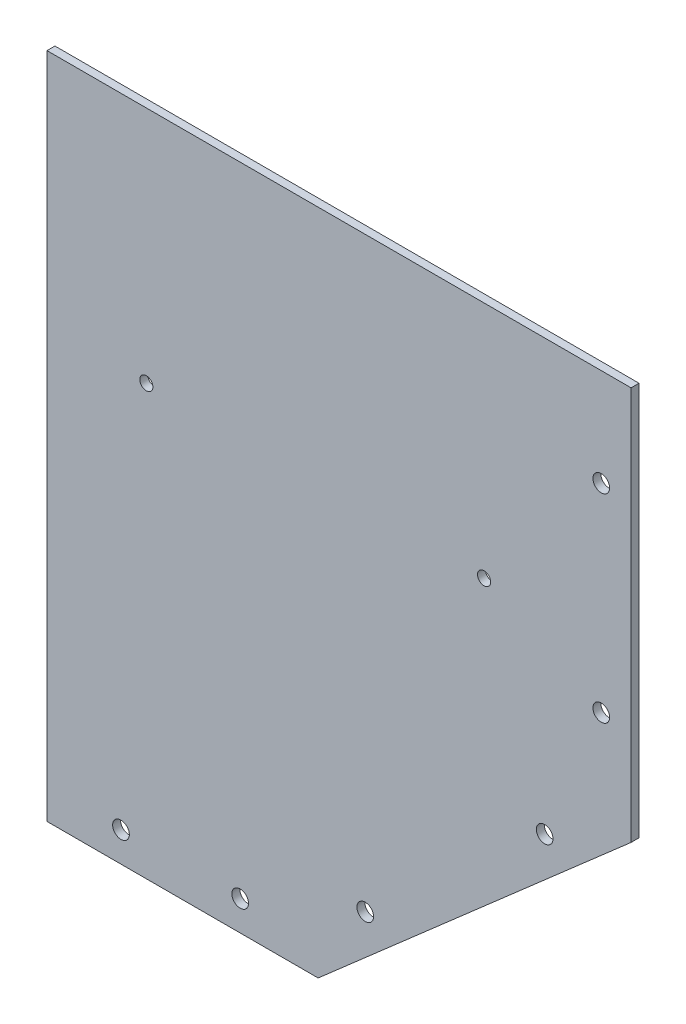
ISO-10303-21;
HEADER;
FILE_DESCRIPTION(('STEP AP214'),'2;1');
FILE_NAME('part.step','',(''),(''),'','','');
FILE_SCHEMA(('AUTOMOTIVE_DESIGN { 1 0 10303 214 1 1 1 1 }'));
ENDSEC;
DATA;
#1=APPLICATION_CONTEXT('core data for automotive mechanical design processes');
#2=APPLICATION_PROTOCOL_DEFINITION('international standard','automotive_design',2000,#1);
#3=PRODUCT_CONTEXT('',#1,'mechanical');
#4=PRODUCT('Part','Part','',(#3));
#5=PRODUCT_RELATED_PRODUCT_CATEGORY('part','',(#4));
#6=PRODUCT_DEFINITION_FORMATION('','',#4);
#7=PRODUCT_DEFINITION_CONTEXT('part definition',#1,'design');
#8=PRODUCT_DEFINITION('design','',#6,#7);
#9=PRODUCT_DEFINITION_SHAPE('','',#8);
#10=(LENGTH_UNIT() NAMED_UNIT(*) SI_UNIT(.MILLI.,.METRE.));
#11=(NAMED_UNIT(*) PLANE_ANGLE_UNIT() SI_UNIT($,.RADIAN.));
#12=(NAMED_UNIT(*) SI_UNIT($,.STERADIAN.) SOLID_ANGLE_UNIT());
#13=UNCERTAINTY_MEASURE_WITH_UNIT(LENGTH_MEASURE(1.E-05),#10,'distance_accuracy_value','');
#14=(GEOMETRIC_REPRESENTATION_CONTEXT(3) GLOBAL_UNCERTAINTY_ASSIGNED_CONTEXT((#13)) GLOBAL_UNIT_ASSIGNED_CONTEXT((#10,
#11,#12)) REPRESENTATION_CONTEXT('',''));
#15=CARTESIAN_POINT('',(0.,0.,0.));
#16=DIRECTION('',(0.,0.,1.));
#17=DIRECTION('',(1.,0.,0.));
#18=AXIS2_PLACEMENT_3D('',#15,#16,#17);
#19=CARTESIAN_POINT('',(0.,0.,2.));
#20=DIRECTION('',(0.,1.,0.));
#21=DIRECTION('',(0.,0.,1.));
#22=AXIS2_PLACEMENT_3D('',#19,#20,#21);
#23=PLANE('',#22);
#24=DIRECTION('',(1.,0.,0.));
#25=VECTOR('',#24,1.);
#26=CARTESIAN_POINT('',(0.,0.,0.));
#27=LINE('',#26,#25);
#28=CARTESIAN_POINT('',(0.,0.,0.));
#29=VERTEX_POINT('',#28);
#30=CARTESIAN_POINT('',(68.24,0.,0.));
#31=VERTEX_POINT('',#30);
#32=EDGE_CURVE('E132',#29,#31,#27,.T.);
#33=ORIENTED_EDGE('',*,*,#32,.T.);
#34=DIRECTION('',(0.,0.,-1.));
#35=VECTOR('',#34,1.);
#36=CARTESIAN_POINT('',(68.24,0.,2.));
#37=LINE('',#36,#35);
#38=CARTESIAN_POINT('',(68.24,0.,2.));
#39=VERTEX_POINT('',#38);
#40=EDGE_CURVE('E11',#39,#31,#37,.T.);
#41=ORIENTED_EDGE('',*,*,#40,.F.);
#42=DIRECTION('',(1.,0.,0.));
#43=VECTOR('',#42,1.);
#44=CARTESIAN_POINT('',(0.,0.,2.));
#45=LINE('',#44,#43);
#46=CARTESIAN_POINT('',(0.,0.,2.));
#47=VERTEX_POINT('',#46);
#48=EDGE_CURVE('E149',#47,#39,#45,.T.);
#49=ORIENTED_EDGE('',*,*,#48,.F.);
#50=DIRECTION('',(0.,0.,-1.));
#51=VECTOR('',#50,1.);
#52=CARTESIAN_POINT('',(0.,0.,2.));
#53=LINE('',#52,#51);
#54=EDGE_CURVE('E109',#47,#29,#53,.T.);
#55=ORIENTED_EDGE('',*,*,#54,.T.);
#56=EDGE_LOOP('',(#33,#41,#49,#55));
#57=FACE_BOUND('',#56,.T.);
#58=ADVANCED_FACE('F37',(#57),#23,.F.);
#59=CARTESIAN_POINT('',(29.5956067368034,-33.8186969825855,2.));
#60=DIRECTION('',(-0.658558128911921,0.752529860433478,0.));
#61=DIRECTION('',(-0.752529860433478,-0.658558128911921,0.));
#62=AXIS2_PLACEMENT_3D('',#59,#60,#61);
#63=PLANE('',#62);
#64=DIRECTION('',(0.752529860433478,0.658558128911921,0.));
#65=VECTOR('',#64,1.);
#66=CARTESIAN_POINT('',(29.5956067368034,-33.8186969825855,0.));
#67=LINE('',#66,#65);
#68=CARTESIAN_POINT('',(146.992249894363,68.9181081906326,0.));
#69=VERTEX_POINT('',#68);
#70=EDGE_CURVE('E135',#31,#69,#67,.T.);
#71=ORIENTED_EDGE('',*,*,#70,.T.);
#72=DIRECTION('',(0.,0.,-1.));
#73=VECTOR('',#72,1.);
#74=CARTESIAN_POINT('',(146.992249894363,68.9181081906326,2.));
#75=LINE('',#74,#73);
#76=CARTESIAN_POINT('',(146.992249894363,68.9181081906326,2.));
#77=VERTEX_POINT('',#76);
#78=EDGE_CURVE('E47',#77,#69,#75,.T.);
#79=ORIENTED_EDGE('',*,*,#78,.F.);
#80=DIRECTION('',(0.752529860433478,0.658558128911921,0.));
#81=VECTOR('',#80,1.);
#82=CARTESIAN_POINT('',(29.5956067368034,-33.8186969825855,2.));
#83=LINE('',#82,#81);
#84=EDGE_CURVE('E89',#39,#77,#83,.T.);
#85=ORIENTED_EDGE('',*,*,#84,.F.);
#86=ORIENTED_EDGE('',*,*,#40,.T.);
#87=EDGE_LOOP('',(#71,#79,#85,#86));
#88=FACE_BOUND('',#87,.T.);
#89=ADVANCED_FACE('F164',(#88),#63,.F.);
#90=CARTESIAN_POINT('',(146.992249894364,1.23517305978068E-13,2.));
#91=DIRECTION('',(-1.,0.,0.));
#92=DIRECTION('',(0.,-1.,0.));
#93=AXIS2_PLACEMENT_3D('',#90,#91,#92);
#94=PLANE('',#93);
#95=DIRECTION('',(0.,1.,0.));
#96=VECTOR('',#95,1.);
#97=CARTESIAN_POINT('',(146.992249894364,1.23517305978068E-13,0.));
#98=LINE('',#97,#96);
#99=CARTESIAN_POINT('',(146.992249894363,168.01,0.));
#100=VERTEX_POINT('',#99);
#101=EDGE_CURVE('E104',#69,#100,#98,.T.);
#102=ORIENTED_EDGE('',*,*,#101,.T.);
#103=DIRECTION('',(0.,0.,-1.));
#104=VECTOR('',#103,1.);
#105=CARTESIAN_POINT('',(146.992249894363,168.01,2.));
#106=LINE('',#105,#104);
#107=CARTESIAN_POINT('',(146.992249894363,168.01,2.));
#108=VERTEX_POINT('',#107);
#109=EDGE_CURVE('E101',#108,#100,#106,.T.);
#110=ORIENTED_EDGE('',*,*,#109,.F.);
#111=DIRECTION('',(0.,1.,0.));
#112=VECTOR('',#111,1.);
#113=CARTESIAN_POINT('',(146.992249894364,1.23517305978068E-13,2.));
#114=LINE('',#113,#112);
#115=EDGE_CURVE('E93',#77,#108,#114,.T.);
#116=ORIENTED_EDGE('',*,*,#115,.F.);
#117=ORIENTED_EDGE('',*,*,#78,.T.);
#118=EDGE_LOOP('',(#102,#110,#116,#117));
#119=FACE_BOUND('',#118,.T.);
#120=ADVANCED_FACE('F102',(#119),#94,.F.);
#121=CARTESIAN_POINT('',(0.,168.01,2.));
#122=DIRECTION('',(0.,-1.,0.));
#123=DIRECTION('',(1.,0.,0.));
#124=AXIS2_PLACEMENT_3D('',#121,#122,#123);
#125=PLANE('',#124);
#126=DIRECTION('',(-1.,0.,0.));
#127=VECTOR('',#126,1.);
#128=CARTESIAN_POINT('',(0.,168.01,0.));
#129=LINE('',#128,#127);
#130=CARTESIAN_POINT('',(0.,168.01,0.));
#131=VERTEX_POINT('',#130);
#132=EDGE_CURVE('E75',#100,#131,#129,.T.);
#133=ORIENTED_EDGE('',*,*,#132,.T.);
#134=DIRECTION('',(0.,0.,-1.));
#135=VECTOR('',#134,1.);
#136=CARTESIAN_POINT('',(0.,168.01,2.));
#137=LINE('',#136,#135);
#138=CARTESIAN_POINT('',(0.,168.01,2.));
#139=VERTEX_POINT('',#138);
#140=EDGE_CURVE('E105',#139,#131,#137,.T.);
#141=ORIENTED_EDGE('',*,*,#140,.F.);
#142=DIRECTION('',(-1.,0.,0.));
#143=VECTOR('',#142,1.);
#144=CARTESIAN_POINT('',(0.,168.01,2.));
#145=LINE('',#144,#143);
#146=EDGE_CURVE('E97',#108,#139,#145,.T.);
#147=ORIENTED_EDGE('',*,*,#146,.F.);
#148=ORIENTED_EDGE('',*,*,#109,.T.);
#149=EDGE_LOOP('',(#133,#141,#147,#148));
#150=FACE_BOUND('',#149,.T.);
#151=ADVANCED_FACE('F107',(#150),#125,.F.);
#152=CARTESIAN_POINT('',(48.62,7.5,2.));
#153=DIRECTION('',(0.,0.,-1.));
#154=DIRECTION('',(-1.,0.,0.));
#155=AXIS2_PLACEMENT_3D('',#152,#153,#154);
#156=CYLINDRICAL_SURFACE('',#155,2.1);
#157=CARTESIAN_POINT('',(48.62,7.5,2.));
#158=DIRECTION('',(0.,0.,1.));
#159=DIRECTION('',(1.,0.,0.));
#160=AXIS2_PLACEMENT_3D('',#157,#158,#159);
#161=CIRCLE('',#160,2.1);
#162=CARTESIAN_POINT('',(50.72,7.5,2.));
#163=VERTEX_POINT('',#162);
#164=EDGE_CURVE('E249',#163,#163,#161,.T.);
#165=ORIENTED_EDGE('',*,*,#164,.T.);
#166=EDGE_LOOP('',(#165));
#167=FACE_BOUND('',#166,.T.);
#168=CARTESIAN_POINT('',(48.62,7.5,0.));
#169=DIRECTION('',(0.,0.,1.));
#170=DIRECTION('',(1.,0.,0.));
#171=AXIS2_PLACEMENT_3D('',#168,#169,#170);
#172=CIRCLE('',#171,2.1);
#173=CARTESIAN_POINT('',(50.72,7.5,0.));
#174=VERTEX_POINT('',#173);
#175=EDGE_CURVE('E129',#174,#174,#172,.T.);
#176=ORIENTED_EDGE('',*,*,#175,.F.);
#177=EDGE_LOOP('',(#176));
#178=FACE_BOUND('',#177,.T.);
#179=ADVANCED_FACE('F172',(#167,#178),#156,.F.);
#180=CARTESIAN_POINT('',(18.62,7.5,2.));
#181=DIRECTION('',(0.,0.,-1.));
#182=DIRECTION('',(-1.,0.,0.));
#183=AXIS2_PLACEMENT_3D('',#180,#181,#182);
#184=CYLINDRICAL_SURFACE('',#183,2.1);
#185=CARTESIAN_POINT('',(18.62,7.5,2.));
#186=DIRECTION('',(0.,0.,1.));
#187=DIRECTION('',(1.,0.,0.));
#188=AXIS2_PLACEMENT_3D('',#185,#186,#187);
#189=CIRCLE('',#188,2.1);
#190=CARTESIAN_POINT('',(20.72,7.5,2.));
#191=VERTEX_POINT('',#190);
#192=EDGE_CURVE('E246',#191,#191,#189,.T.);
#193=ORIENTED_EDGE('',*,*,#192,.T.);
#194=EDGE_LOOP('',(#193));
#195=FACE_BOUND('',#194,.T.);
#196=CARTESIAN_POINT('',(18.62,7.5,0.));
#197=DIRECTION('',(0.,0.,1.));
#198=DIRECTION('',(1.,0.,0.));
#199=AXIS2_PLACEMENT_3D('',#196,#197,#198);
#200=CIRCLE('',#199,2.1);
#201=CARTESIAN_POINT('',(20.72,7.5,0.));
#202=VERTEX_POINT('',#201);
#203=EDGE_CURVE('E126',#202,#202,#200,.T.);
#204=ORIENTED_EDGE('',*,*,#203,.F.);
#205=EDGE_LOOP('',(#204));
#206=FACE_BOUND('',#205,.T.);
#207=ADVANCED_FACE('F175',(#195,#206),#184,.F.);
#208=CARTESIAN_POINT('',(139.492249894363,143.468108190633,2.));
#209=DIRECTION('',(0.,0.,-1.));
#210=DIRECTION('',(-1.,0.,0.));
#211=AXIS2_PLACEMENT_3D('',#208,#209,#210);
#212=CYLINDRICAL_SURFACE('',#211,2.09999999999999);
#213=CARTESIAN_POINT('',(139.492249894363,143.468108190633,2.));
#214=DIRECTION('',(0.,0.,1.));
#215=DIRECTION('',(1.,0.,0.));
#216=AXIS2_PLACEMENT_3D('',#213,#214,#215);
#217=CIRCLE('',#216,2.09999999999999);
#218=CARTESIAN_POINT('',(141.592249894363,143.468108190633,2.));
#219=VERTEX_POINT('',#218);
#220=EDGE_CURVE('E243',#219,#219,#217,.T.);
#221=ORIENTED_EDGE('',*,*,#220,.T.);
#222=EDGE_LOOP('',(#221));
#223=FACE_BOUND('',#222,.T.);
#224=CARTESIAN_POINT('',(139.492249894363,143.468108190633,0.));
#225=DIRECTION('',(0.,0.,1.));
#226=DIRECTION('',(1.,0.,0.));
#227=AXIS2_PLACEMENT_3D('',#224,#225,#226);
#228=CIRCLE('',#227,2.09999999999999);
#229=CARTESIAN_POINT('',(141.592249894363,143.468108190633,0.));
#230=VERTEX_POINT('',#229);
#231=EDGE_CURVE('E123',#230,#230,#228,.T.);
#232=ORIENTED_EDGE('',*,*,#231,.F.);
#233=EDGE_LOOP('',(#232));
#234=FACE_BOUND('',#233,.T.);
#235=ADVANCED_FACE('F179',(#223,#234),#212,.F.);
#236=CARTESIAN_POINT('',(139.492249894363,93.4681081906326,2.));
#237=DIRECTION('',(0.,0.,-1.));
#238=DIRECTION('',(-1.,0.,0.));
#239=AXIS2_PLACEMENT_3D('',#236,#237,#238);
#240=CYLINDRICAL_SURFACE('',#239,2.09999999999999);
#241=CARTESIAN_POINT('',(139.492249894363,93.4681081906326,2.));
#242=DIRECTION('',(0.,0.,1.));
#243=DIRECTION('',(1.,0.,0.));
#244=AXIS2_PLACEMENT_3D('',#241,#242,#243);
#245=CIRCLE('',#244,2.09999999999999);
#246=CARTESIAN_POINT('',(141.592249894363,93.4681081906326,2.));
#247=VERTEX_POINT('',#246);
#248=EDGE_CURVE('E240',#247,#247,#245,.T.);
#249=ORIENTED_EDGE('',*,*,#248,.T.);
#250=EDGE_LOOP('',(#249));
#251=FACE_BOUND('',#250,.T.);
#252=CARTESIAN_POINT('',(139.492249894363,93.4681081906326,0.));
#253=DIRECTION('',(0.,0.,1.));
#254=DIRECTION('',(1.,0.,0.));
#255=AXIS2_PLACEMENT_3D('',#252,#253,#254);
#256=CIRCLE('',#255,2.09999999999999);
#257=CARTESIAN_POINT('',(141.592249894363,93.4681081906326,0.));
#258=VERTEX_POINT('',#257);
#259=EDGE_CURVE('E120',#258,#258,#256,.T.);
#260=ORIENTED_EDGE('',*,*,#259,.F.);
#261=EDGE_LOOP('',(#260));
#262=FACE_BOUND('',#261,.T.);
#263=ADVANCED_FACE('F183',(#251,#262),#240,.F.);
#264=CARTESIAN_POINT('',(80.0972805180358,20.3429913905652,2.));
#265=DIRECTION('',(0.,0.,-1.));
#266=DIRECTION('',(-1.,0.,0.));
#267=AXIS2_PLACEMENT_3D('',#264,#265,#266);
#268=CYLINDRICAL_SURFACE('',#267,2.1);
#269=CARTESIAN_POINT('',(80.0972805180358,20.3429913905652,2.));
#270=DIRECTION('',(0.,0.,1.));
#271=DIRECTION('',(1.,0.,0.));
#272=AXIS2_PLACEMENT_3D('',#269,#270,#271);
#273=CIRCLE('',#272,2.1);
#274=CARTESIAN_POINT('',(82.1972805180358,20.3429913905652,2.));
#275=VERTEX_POINT('',#274);
#276=EDGE_CURVE('E194',#275,#275,#273,.T.);
#277=ORIENTED_EDGE('',*,*,#276,.T.);
#278=EDGE_LOOP('',(#277));
#279=FACE_BOUND('',#278,.T.);
#280=CARTESIAN_POINT('',(80.0972805180358,20.3429913905652,0.));
#281=DIRECTION('',(0.,0.,1.));
#282=DIRECTION('',(1.,0.,0.));
#283=AXIS2_PLACEMENT_3D('',#280,#281,#282);
#284=CIRCLE('',#283,2.1);
#285=CARTESIAN_POINT('',(82.1972805180358,20.3429913905652,0.));
#286=VERTEX_POINT('',#285);
#287=EDGE_CURVE('E116',#286,#286,#284,.T.);
#288=ORIENTED_EDGE('',*,*,#287,.F.);
#289=EDGE_LOOP('',(#288));
#290=FACE_BOUND('',#289,.T.);
#291=ADVANCED_FACE('F159',(#279,#290),#268,.F.);
#292=CARTESIAN_POINT('',(125.249072144044,59.8564791252805,2.));
#293=DIRECTION('',(0.,0.,-1.));
#294=DIRECTION('',(-1.,0.,0.));
#295=AXIS2_PLACEMENT_3D('',#292,#293,#294);
#296=CYLINDRICAL_SURFACE('',#295,2.09999999999999);
#297=CARTESIAN_POINT('',(125.249072144044,59.8564791252805,2.));
#298=DIRECTION('',(0.,0.,1.));
#299=DIRECTION('',(1.,0.,0.));
#300=AXIS2_PLACEMENT_3D('',#297,#298,#299);
#301=CIRCLE('',#300,2.09999999999999);
#302=CARTESIAN_POINT('',(127.349072144044,59.8564791252805,2.));
#303=VERTEX_POINT('',#302);
#304=EDGE_CURVE('E140',#303,#303,#301,.T.);
#305=ORIENTED_EDGE('',*,*,#304,.T.);
#306=EDGE_LOOP('',(#305));
#307=FACE_BOUND('',#306,.T.);
#308=CARTESIAN_POINT('',(125.249072144044,59.8564791252805,0.));
#309=DIRECTION('',(0.,0.,1.));
#310=DIRECTION('',(1.,0.,0.));
#311=AXIS2_PLACEMENT_3D('',#308,#309,#310);
#312=CIRCLE('',#311,2.09999999999999);
#313=CARTESIAN_POINT('',(127.349072144044,59.8564791252805,0.));
#314=VERTEX_POINT('',#313);
#315=EDGE_CURVE('E113',#314,#314,#312,.T.);
#316=ORIENTED_EDGE('',*,*,#315,.F.);
#317=EDGE_LOOP('',(#316));
#318=FACE_BOUND('',#317,.T.);
#319=ADVANCED_FACE('F39',(#307,#318),#296,.F.);
#320=CARTESIAN_POINT('',(0.,0.,2.));
#321=DIRECTION('',(1.,0.,0.));
#322=DIRECTION('',(0.,1.,0.));
#323=AXIS2_PLACEMENT_3D('',#320,#321,#322);
#324=PLANE('',#323);
#325=DIRECTION('',(0.,-1.,0.));
#326=VECTOR('',#325,1.);
#327=CARTESIAN_POINT('',(0.,0.,0.));
#328=LINE('',#327,#326);
#329=EDGE_CURVE('E81',#131,#29,#328,.T.);
#330=ORIENTED_EDGE('',*,*,#329,.T.);
#331=ORIENTED_EDGE('',*,*,#54,.F.);
#332=DIRECTION('',(0.,-1.,0.));
#333=VECTOR('',#332,1.);
#334=CARTESIAN_POINT('',(0.,0.,2.));
#335=LINE('',#334,#333);
#336=EDGE_CURVE('E55',#139,#47,#335,.T.);
#337=ORIENTED_EDGE('',*,*,#336,.F.);
#338=ORIENTED_EDGE('',*,*,#140,.T.);
#339=EDGE_LOOP('',(#330,#331,#337,#338));
#340=FACE_BOUND('',#339,.T.);
#341=ADVANCED_FACE('F150',(#340),#324,.F.);
#342=CARTESIAN_POINT('',(0.,0.,2.));
#343=DIRECTION('',(0.,0.,1.));
#344=DIRECTION('',(1.,0.,0.));
#345=AXIS2_PLACEMENT_3D('',#342,#343,#344);
#346=PLANE('',#345);
#347=CARTESIAN_POINT('',(25.,108.01,2.));
#348=DIRECTION('',(0.,0.,1.));
#349=DIRECTION('',(1.,0.,0.));
#350=AXIS2_PLACEMENT_3D('',#347,#348,#349);
#351=CIRCLE('',#350,1.64999999999999);
#352=CARTESIAN_POINT('',(26.65,108.01,2.));
#353=VERTEX_POINT('',#352);
#354=EDGE_CURVE('E228',#353,#353,#351,.T.);
#355=ORIENTED_EDGE('',*,*,#354,.F.);
#356=EDGE_LOOP('',(#355));
#357=FACE_BOUND('',#356,.T.);
#358=CARTESIAN_POINT('',(110.,108.01,2.));
#359=DIRECTION('',(0.,0.,1.));
#360=DIRECTION('',(1.,0.,0.));
#361=AXIS2_PLACEMENT_3D('',#358,#359,#360);
#362=CIRCLE('',#361,1.64999999999998);
#363=CARTESIAN_POINT('',(111.65,108.01,2.));
#364=VERTEX_POINT('',#363);
#365=EDGE_CURVE('E230',#364,#364,#362,.T.);
#366=ORIENTED_EDGE('',*,*,#365,.F.);
#367=EDGE_LOOP('',(#366));
#368=FACE_BOUND('',#367,.T.);
#369=ORIENTED_EDGE('',*,*,#304,.F.);
#370=EDGE_LOOP('',(#369));
#371=FACE_BOUND('',#370,.T.);
#372=ORIENTED_EDGE('',*,*,#276,.F.);
#373=EDGE_LOOP('',(#372));
#374=FACE_BOUND('',#373,.T.);
#375=ORIENTED_EDGE('',*,*,#248,.F.);
#376=EDGE_LOOP('',(#375));
#377=FACE_BOUND('',#376,.T.);
#378=ORIENTED_EDGE('',*,*,#220,.F.);
#379=EDGE_LOOP('',(#378));
#380=FACE_BOUND('',#379,.T.);
#381=ORIENTED_EDGE('',*,*,#192,.F.);
#382=EDGE_LOOP('',(#381));
#383=FACE_BOUND('',#382,.T.);
#384=ORIENTED_EDGE('',*,*,#164,.F.);
#385=EDGE_LOOP('',(#384));
#386=FACE_BOUND('',#385,.T.);
#387=ORIENTED_EDGE('',*,*,#48,.T.);
#388=ORIENTED_EDGE('',*,*,#84,.T.);
#389=ORIENTED_EDGE('',*,*,#115,.T.);
#390=ORIENTED_EDGE('',*,*,#146,.T.);
#391=ORIENTED_EDGE('',*,*,#336,.T.);
#392=EDGE_LOOP('',(#387,#388,#389,#390,#391));
#393=FACE_BOUND('',#392,.T.);
#394=ADVANCED_FACE('F95',(#357,#368,#371,#374,#377,#380,#383,#386,#393),#346,.T.);
#395=CARTESIAN_POINT('',(0.,0.,0.));
#396=DIRECTION('',(0.,0.,1.));
#397=DIRECTION('',(1.,0.,0.));
#398=AXIS2_PLACEMENT_3D('',#395,#396,#397);
#399=PLANE('',#398);
#400=CARTESIAN_POINT('',(25.,108.01,0.));
#401=DIRECTION('',(0.,0.,1.));
#402=DIRECTION('',(1.,0.,0.));
#403=AXIS2_PLACEMENT_3D('',#400,#401,#402);
#404=CIRCLE('',#403,1.64999999999999);
#405=CARTESIAN_POINT('',(26.65,108.01,0.));
#406=VERTEX_POINT('',#405);
#407=EDGE_CURVE('E41',#406,#406,#404,.T.);
#408=ORIENTED_EDGE('',*,*,#407,.T.);
#409=EDGE_LOOP('',(#408));
#410=FACE_BOUND('',#409,.T.);
#411=CARTESIAN_POINT('',(110.,108.01,0.));
#412=DIRECTION('',(0.,0.,1.));
#413=DIRECTION('',(1.,0.,0.));
#414=AXIS2_PLACEMENT_3D('',#411,#412,#413);
#415=CIRCLE('',#414,1.64999999999998);
#416=CARTESIAN_POINT('',(111.65,108.01,0.));
#417=VERTEX_POINT('',#416);
#418=EDGE_CURVE('E117',#417,#417,#415,.T.);
#419=ORIENTED_EDGE('',*,*,#418,.T.);
#420=EDGE_LOOP('',(#419));
#421=FACE_BOUND('',#420,.T.);
#422=ORIENTED_EDGE('',*,*,#315,.T.);
#423=EDGE_LOOP('',(#422));
#424=FACE_BOUND('',#423,.T.);
#425=ORIENTED_EDGE('',*,*,#287,.T.);
#426=EDGE_LOOP('',(#425));
#427=FACE_BOUND('',#426,.T.);
#428=ORIENTED_EDGE('',*,*,#259,.T.);
#429=EDGE_LOOP('',(#428));
#430=FACE_BOUND('',#429,.T.);
#431=ORIENTED_EDGE('',*,*,#231,.T.);
#432=EDGE_LOOP('',(#431));
#433=FACE_BOUND('',#432,.T.);
#434=ORIENTED_EDGE('',*,*,#203,.T.);
#435=EDGE_LOOP('',(#434));
#436=FACE_BOUND('',#435,.T.);
#437=ORIENTED_EDGE('',*,*,#175,.T.);
#438=EDGE_LOOP('',(#437));
#439=FACE_BOUND('',#438,.T.);
#440=ORIENTED_EDGE('',*,*,#32,.F.);
#441=ORIENTED_EDGE('',*,*,#329,.F.);
#442=ORIENTED_EDGE('',*,*,#132,.F.);
#443=ORIENTED_EDGE('',*,*,#101,.F.);
#444=ORIENTED_EDGE('',*,*,#70,.F.);
#445=EDGE_LOOP('',(#440,#441,#442,#443,#444));
#446=FACE_BOUND('',#445,.T.);
#447=ADVANCED_FACE('F145',(#410,#421,#424,#427,#430,#433,#436,#439,#446),#399,.F.);
#448=CARTESIAN_POINT('',(110.,108.01,2.));
#449=DIRECTION('',(0.,0.,1.));
#450=DIRECTION('',(1.,0.,0.));
#451=AXIS2_PLACEMENT_3D('',#448,#449,#450);
#452=CYLINDRICAL_SURFACE('',#451,1.64999999999998);
#453=ORIENTED_EDGE('',*,*,#365,.T.);
#454=EDGE_LOOP('',(#453));
#455=FACE_BOUND('',#454,.T.);
#456=ORIENTED_EDGE('',*,*,#418,.F.);
#457=EDGE_LOOP('',(#456));
#458=FACE_BOUND('',#457,.T.);
#459=ADVANCED_FACE('F199',(#455,#458),#452,.F.);
#460=CARTESIAN_POINT('',(25.,108.01,2.));
#461=DIRECTION('',(0.,0.,1.));
#462=DIRECTION('',(1.,0.,0.));
#463=AXIS2_PLACEMENT_3D('',#460,#461,#462);
#464=CYLINDRICAL_SURFACE('',#463,1.64999999999999);
#465=ORIENTED_EDGE('',*,*,#354,.T.);
#466=EDGE_LOOP('',(#465));
#467=FACE_BOUND('',#466,.T.);
#468=ORIENTED_EDGE('',*,*,#407,.F.);
#469=EDGE_LOOP('',(#468));
#470=FACE_BOUND('',#469,.T.);
#471=ADVANCED_FACE('F215',(#467,#470),#464,.F.);
#472=CLOSED_SHELL('',(#58,#89,#120,#151,#179,#207,#235,#263,#291,#319,#341,#394,#447,#459,#471));
#473=MANIFOLD_SOLID_BREP('B2',#472);
#474=ADVANCED_BREP_SHAPE_REPRESENTATION('',(#18,#473),#14);
#475=SHAPE_DEFINITION_REPRESENTATION(#9,#474);
ENDSEC;
END-ISO-10303-21;
